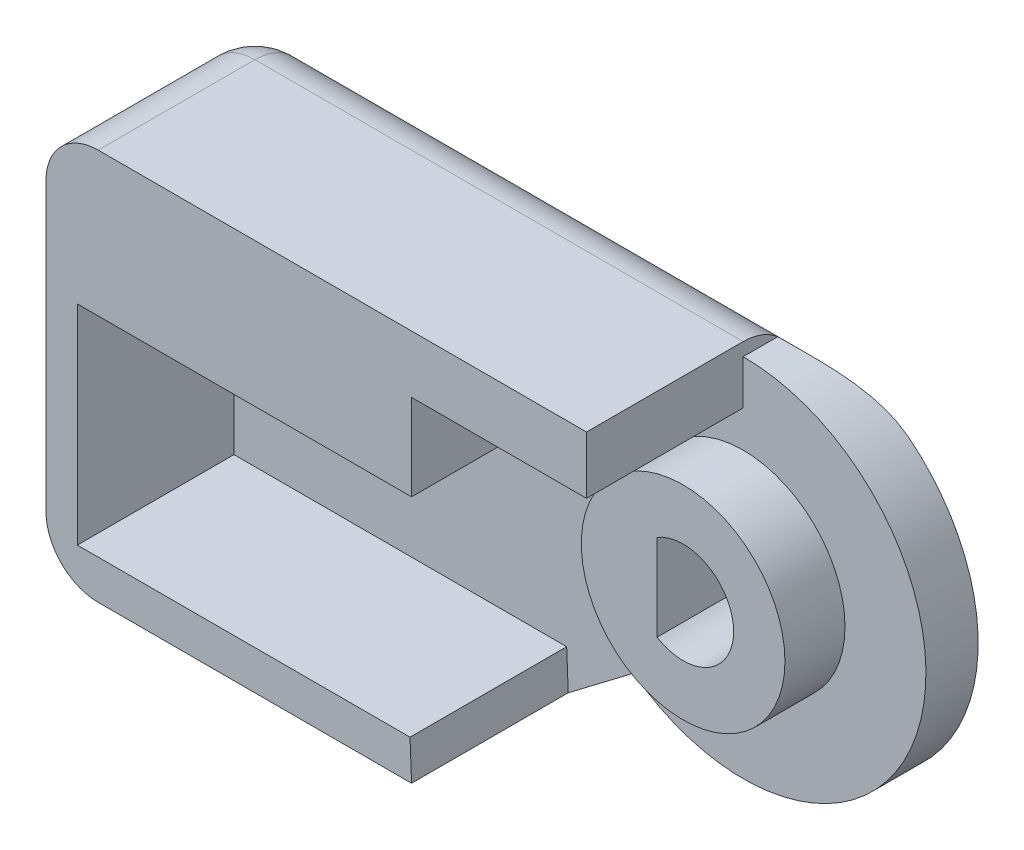
ISO-10303-21;
HEADER;
FILE_DESCRIPTION(('STEP AP214'),'2;1');
FILE_NAME('part.step','',(''),(''),'','','');
FILE_SCHEMA(('AUTOMOTIVE_DESIGN { 1 0 10303 214 1 1 1 1 }'));
ENDSEC;
DATA;
#1=APPLICATION_CONTEXT('core data for automotive mechanical design processes');
#2=APPLICATION_PROTOCOL_DEFINITION('international standard','automotive_design',2000,#1);
#3=PRODUCT_CONTEXT('',#1,'mechanical');
#4=PRODUCT('Part','Part','',(#3));
#5=PRODUCT_RELATED_PRODUCT_CATEGORY('part','',(#4));
#6=PRODUCT_DEFINITION_FORMATION('','',#4);
#7=PRODUCT_DEFINITION_CONTEXT('part definition',#1,'design');
#8=PRODUCT_DEFINITION('design','',#6,#7);
#9=PRODUCT_DEFINITION_SHAPE('','',#8);
#10=(LENGTH_UNIT() NAMED_UNIT(*) SI_UNIT(.MILLI.,.METRE.));
#11=(NAMED_UNIT(*) PLANE_ANGLE_UNIT() SI_UNIT($,.RADIAN.));
#12=(NAMED_UNIT(*) SI_UNIT($,.STERADIAN.) SOLID_ANGLE_UNIT());
#13=UNCERTAINTY_MEASURE_WITH_UNIT(LENGTH_MEASURE(1.E-05),#10,'distance_accuracy_value','');
#14=(GEOMETRIC_REPRESENTATION_CONTEXT(3) GLOBAL_UNCERTAINTY_ASSIGNED_CONTEXT((#13)) GLOBAL_UNIT_ASSIGNED_CONTEXT((#10,
#11,#12)) REPRESENTATION_CONTEXT('',''));
#15=CARTESIAN_POINT('',(0.,0.,0.));
#16=DIRECTION('',(0.,0.,1.));
#17=DIRECTION('',(1.,0.,0.));
#18=AXIS2_PLACEMENT_3D('',#15,#16,#17);
#19=CARTESIAN_POINT('',(-6.69999999999999,-7.5,2.));
#20=DIRECTION('',(-0.605083267533557,0.796162194123103,0.));
#21=DIRECTION('',(-0.796162194123103,-0.605083267533557,0.));
#22=AXIS2_PLACEMENT_3D('',#19,#20,#21);
#23=PLANE('',#22);
#24=DIRECTION('',(0.796162194123103,0.605083267533557,0.));
#25=VECTOR('',#24,1.);
#26=CARTESIAN_POINT('',(-6.69999999999999,-7.5,2.));
#27=LINE('',#26,#25);
#28=CARTESIAN_POINT('',(-6.69999999999999,-7.5,2.));
#29=VERTEX_POINT('',#28);
#30=CARTESIAN_POINT('',(-4.19999999999999,-5.6,2.));
#31=VERTEX_POINT('',#30);
#32=EDGE_CURVE('E356',#29,#31,#27,.T.);
#33=ORIENTED_EDGE('',*,*,#32,.F.);
#34=CARTESIAN_POINT('',(-4.06842105263157,-5.5,2.));
#35=DIRECTION('',(-0.605083267533557,0.796162194123103,0.));
#36=DIRECTION('',(0.796162194123103,0.605083267533557,0.));
#37=AXIS2_PLACEMENT_3D('',#34,#35,#36);
#38=ELLIPSE('',#37,3.30533020381213,2.);
#39=CARTESIAN_POINT('',(-4.19999999999999,-5.6,0.00250156445618212));
#40=VERTEX_POINT('',#39);
#41=EDGE_CURVE('E400',#29,#40,#38,.F.);
#42=ORIENTED_EDGE('',*,*,#41,.T.);
#43=DIRECTION('',(0.,0.,-1.));
#44=VECTOR('',#43,1.);
#45=CARTESIAN_POINT('',(-4.19999999999999,-5.6,2.));
#46=LINE('',#45,#44);
#47=EDGE_CURVE('E374',#31,#40,#46,.T.);
#48=ORIENTED_EDGE('',*,*,#47,.F.);
#49=EDGE_LOOP('',(#33,#42,#48));
#50=FACE_BOUND('',#49,.T.);
#51=ADVANCED_FACE('F41',(#50),#23,.F.);
#52=CARTESIAN_POINT('',(0.,0.,2.));
#53=DIRECTION('',(0.,0.,-1.));
#54=DIRECTION('',(-1.,0.,0.));
#55=AXIS2_PLACEMENT_3D('',#52,#53,#54);
#56=CYLINDRICAL_SURFACE('',#55,7.);
#57=ORIENTED_EDGE('',*,*,#47,.T.);
#58=CARTESIAN_POINT('',(-4.19999999999999,-5.6,0.00250156445618212));
#59=CARTESIAN_POINT('',(-4.14155677091688,-5.64383364656433,0.00469952163115076));
#60=CARTESIAN_POINT('',(-4.08247489335822,-5.68671414896043,0.00828869119228509));
#61=CARTESIAN_POINT('',(-3.96315425682548,-5.77050416877245,0.0179282990885862));
#62=CARTESIAN_POINT('',(-3.90291590041761,-5.81141435525347,0.0239778952453179));
#63=CARTESIAN_POINT('',(-3.72082453154506,-5.9309798197126,0.0453118131867991));
#64=CARTESIAN_POINT('',(-3.59736509532927,-6.00664238183177,0.0637924151711754));
#65=CARTESIAN_POINT('',(-3.34694103931241,-6.14969803370949,0.106993978170742));
#66=CARTESIAN_POINT('',(-3.21997805587572,-6.2170949065567,0.131712068417762));
#67=CARTESIAN_POINT('',(-2.96282067256636,-6.34367735830443,0.18535568403568));
#68=CARTESIAN_POINT('',(-2.83262460876637,-6.4028586012088,0.214283414774047));
#69=CARTESIAN_POINT('',(-2.55606723946253,-6.51852705543578,0.277395553825556));
#70=CARTESIAN_POINT('',(-2.40939692775104,-6.57414491448922,0.311816048074821));
#71=CARTESIAN_POINT('',(-2.11266766002374,-6.67541854490851,0.380697859311953));
#72=CARTESIAN_POINT('',(-1.96260868898433,-6.72107427209771,0.415159176480166));
#73=CARTESIAN_POINT('',(-1.65945968916546,-6.80226188299332,0.481169665050858));
#74=CARTESIAN_POINT('',(-1.50637621880534,-6.83781354685916,0.512724443373316));
#75=CARTESIAN_POINT('',(-1.19706124762865,-6.898686220958,0.569816211850915));
#76=CARTESIAN_POINT('',(-1.04083031774035,-6.92400906939672,0.595354282915791));
#77=CARTESIAN_POINT('',(-0.741807055584375,-6.96204392662197,0.635041896324527));
#78=CARTESIAN_POINT('',(-0.599267353525983,-6.97577794921926,0.650086679191348));
#79=CARTESIAN_POINT('',(-0.312945705052151,-6.99447141663507,0.670805502954452));
#80=CARTESIAN_POINT('',(-0.169164147947374,-6.99943351772978,0.676482380565558));
#81=CARTESIAN_POINT('',(0.118509225457222,-7.00047484194157,0.67766240142979));
#82=CARTESIAN_POINT('',(0.262401059546263,-6.99655201453542,0.673163196178784));
#83=CARTESIAN_POINT('',(0.549064984305977,-6.97991116000069,0.654634160806131));
#84=CARTESIAN_POINT('',(0.691836725118352,-6.96719048748482,0.640601464121234));
#85=CARTESIAN_POINT('',(1.01869387763681,-6.92798825919138,0.599326926659698));
#86=CARTESIAN_POINT('',(1.20206713108597,-6.89848886155583,0.569358504143854));
#87=CARTESIAN_POINT('',(1.56449553853169,-6.82543663573275,0.501438556341681));
#88=CARTESIAN_POINT('',(1.74354792728012,-6.78187505168562,0.463482062398954));
#89=CARTESIAN_POINT('',(2.09743764222899,-6.6809192346073,0.384590854070274));
#90=CARTESIAN_POINT('',(2.27226526394018,-6.62349597142981,0.34365001694542));
#91=CARTESIAN_POINT('',(2.61715107149113,-6.49494935982821,0.263388242099793));
#92=CARTESIAN_POINT('',(2.78721091771817,-6.42383085043541,0.224066738148717));
#93=CARTESIAN_POINT('',(3.07557253038458,-6.28956451681745,0.161400414913937));
#94=CARTESIAN_POINT('',(3.19510577475859,-6.22970775494248,0.136654977700185));
#95=CARTESIAN_POINT('',(3.43116723033019,-6.10287129667491,0.0918422604149061));
#96=CARTESIAN_POINT('',(3.54769715357752,-6.03589577516384,0.0717722601822776));
#97=CARTESIAN_POINT('',(3.77752251184962,-5.89478554704046,0.0380050847969382));
#98=CARTESIAN_POINT('',(3.89081440395201,-5.82064336034643,0.0243146568551023));
#99=CARTESIAN_POINT('',(4.11357352472038,-5.66542534107307,0.00532804373347942));
#100=CARTESIAN_POINT('',(4.22303303287638,-5.5843365324238,4.79456729129283E-05));
#101=CARTESIAN_POINT('',(4.33012701892219,-5.5,0.));
#102=B_SPLINE_CURVE_WITH_KNOTS('',3,(#58,#59,#60,#61,#62,#63,#64,#65,#66,#67,#68,#69,#70,#71,
#72,#73,#74,#75,#76,#77,#78,#79,#80,#81,#82,#83,#84,#85,#86,#87,#88,#89,#90,#91,#92,#93,#94,#95,
#96,#97,#98,#99,#100,#101),.UNSPECIFIED.,.F.,.F.,(4,2,2,2,2,2,2,2,2,2,2,2,2,2,2,2,2,2,2,2,2,4),
(0.,0.219209885988927,0.438344801777697,0.87575445923389,1.31296316741287,1.75040175279814,
2.23182859789322,2.71325757781189,3.19373749518885,3.67413102775403,4.10557814433781,
4.53689458953522,4.96831058696951,5.39985636150716,5.96331979179677,6.52713474308106,
7.09214088050539,7.65694774569477,8.06454899182243,8.47191250067759,8.87970587595175,
9.28827833796954),.UNSPECIFIED.);
#103=CARTESIAN_POINT('',(4.33012701892219,-5.5,0.));
#104=VERTEX_POINT('',#103);
#105=EDGE_CURVE('E411',#40,#104,#102,.T.);
#106=ORIENTED_EDGE('',*,*,#105,.T.);
#107=CARTESIAN_POINT('',(0.,0.,0.));
#108=DIRECTION('',(0.,0.,1.));
#109=DIRECTION('',(1.,0.,0.));
#110=AXIS2_PLACEMENT_3D('',#107,#108,#109);
#111=CIRCLE('',#110,7.);
#112=CARTESIAN_POINT('',(4.33012701892219,5.5,0.));
#113=VERTEX_POINT('',#112);
#114=EDGE_CURVE('E355',#104,#113,#111,.T.);
#115=ORIENTED_EDGE('',*,*,#114,.T.);
#116=CARTESIAN_POINT('',(4.33012701892219,5.5,0.));
#117=CARTESIAN_POINT('',(4.27565134419388,5.54288992095722,3.16448744951972E-06));
#118=CARTESIAN_POINT('',(4.22055118908445,5.58495739955612,0.00137920884955097));
#119=CARTESIAN_POINT('',(4.10921982008807,5.66737191207902,0.00658748503671268));
#120=CARTESIAN_POINT('',(4.05298900283181,5.70771953434261,0.0104188696136269));
#121=CARTESIAN_POINT('',(3.88295201251372,5.82595174356898,0.0251434771142648));
#122=CARTESIAN_POINT('',(3.76757811117118,5.90120123642492,0.0392695438128536));
#123=CARTESIAN_POINT('',(3.53316867796608,6.04447147088369,0.0741248490571788));
#124=CARTESIAN_POINT('',(3.41412708120154,6.1124793078429,0.094865620778447));
#125=CARTESIAN_POINT('',(3.17294121303797,6.24108419799872,0.141111818725817));
#126=CARTESIAN_POINT('',(3.05079519338518,6.30167695848424,0.166619983484103));
#127=CARTESIAN_POINT('',(2.74812720661775,6.44101724938366,0.232849874085873));
#128=CARTESIAN_POINT('',(2.56607670619923,6.51566010661691,0.27525138661051));
#129=CARTESIAN_POINT('',(2.19652066267236,6.64935665492527,0.361312510867563));
#130=CARTESIAN_POINT('',(2.00901163571028,6.70840013643442,0.404972925905956));
#131=CARTESIAN_POINT('',(1.62962349203863,6.81048795248792,0.487744833269802));
#132=CARTESIAN_POINT('',(1.43776817655619,6.85360395089615,0.526876143503462));
#133=CARTESIAN_POINT('',(1.04942307798488,6.9236918644417,0.594473504953196));
#134=CARTESIAN_POINT('',(0.852940942642479,6.95068870969871,0.622956000141599));
#135=CARTESIAN_POINT('',(0.546501946559715,6.97948287023724,0.654132927098202));
#136=CARTESIAN_POINT('',(0.437672325863815,6.98715560354278,0.662664486590381));
#137=CARTESIAN_POINT('',(0.219244394723554,6.99742378237191,0.674200947052606));
#138=CARTESIAN_POINT('',(0.109644915216933,7.00000793768722,0.677193557679663));
#139=CARTESIAN_POINT('',(0.,7.,0.677124344467703));
#140=B_SPLINE_CURVE_WITH_KNOTS('',3,(#116,#117,#118,#119,#120,#121,#122,#123,#124,#125,#126,
#127,#128,#129,#130,#131,#132,#133,#134,#135,#136,#137,#138,#139),.UNSPECIFIED.,.F.,.F.,(4,2,2,
2,2,2,2,2,2,2,2,4),(0.,0.207949790420002,0.415827863578031,0.830735142610161,1.24636983164467,
1.66224401152001,2.26531055542352,2.868770825355,3.46948183474742,4.06926135273695,
4.39731920210125,4.72610410855595),.UNSPECIFIED.);
#141=CARTESIAN_POINT('',(0.,7.,0.677124344467706));
#142=VERTEX_POINT('',#141);
#143=EDGE_CURVE('E403',#113,#142,#140,.T.);
#144=ORIENTED_EDGE('',*,*,#143,.T.);
#145=DIRECTION('',(0.,0.,-1.));
#146=VECTOR('',#145,1.);
#147=CARTESIAN_POINT('',(0.,7.,2.));
#148=LINE('',#147,#146);
#149=CARTESIAN_POINT('',(0.,7.,2.));
#150=VERTEX_POINT('',#149);
#151=EDGE_CURVE('E370',#150,#142,#148,.T.);
#152=ORIENTED_EDGE('',*,*,#151,.F.);
#153=CARTESIAN_POINT('',(0.,0.,2.));
#154=DIRECTION('',(0.,0.,1.));
#155=DIRECTION('',(1.,0.,0.));
#156=AXIS2_PLACEMENT_3D('',#153,#154,#155);
#157=CIRCLE('',#156,7.);
#158=EDGE_CURVE('E360',#31,#150,#157,.T.);
#159=ORIENTED_EDGE('',*,*,#158,.F.);
#160=EDGE_LOOP('',(#57,#106,#115,#144,#152,#159));
#161=FACE_BOUND('',#160,.T.);
#162=ADVANCED_FACE('F418',(#161),#56,.T.);
#163=CARTESIAN_POINT('',(0.,7.,2.));
#164=DIRECTION('',(-1.,0.,0.));
#165=DIRECTION('',(0.,0.,1.));
#166=AXIS2_PLACEMENT_3D('',#163,#164,#165);
#167=PLANE('',#166);
#168=ORIENTED_EDGE('',*,*,#151,.T.);
#169=CARTESIAN_POINT('',(0.,5.5,2.));
#170=DIRECTION('',(-1.,0.,0.));
#171=DIRECTION('',(0.,0.,1.));
#172=AXIS2_PLACEMENT_3D('',#169,#170,#171);
#173=CIRCLE('',#172,2.);
#174=CARTESIAN_POINT('',(0.,7.5,2.));
#175=VERTEX_POINT('',#174);
#176=EDGE_CURVE('E11',#142,#175,#173,.F.);
#177=ORIENTED_EDGE('',*,*,#176,.T.);
#178=DIRECTION('',(0.,0.,-1.));
#179=VECTOR('',#178,1.);
#180=CARTESIAN_POINT('',(0.,7.5,2.));
#181=LINE('',#180,#179);
#182=CARTESIAN_POINT('',(0.,7.5,8.));
#183=VERTEX_POINT('',#182);
#184=EDGE_CURVE('E363',#183,#175,#181,.T.);
#185=ORIENTED_EDGE('',*,*,#184,.F.);
#186=DIRECTION('',(0.,1.,0.));
#187=VECTOR('',#186,1.);
#188=CARTESIAN_POINT('',(0.,5.3,8.));
#189=LINE('',#188,#187);
#190=CARTESIAN_POINT('',(0.,5.3,8.));
#191=VERTEX_POINT('',#190);
#192=EDGE_CURVE('E288',#191,#183,#189,.T.);
#193=ORIENTED_EDGE('',*,*,#192,.F.);
#194=DIRECTION('',(0.,0.,-1.));
#195=VECTOR('',#194,1.);
#196=CARTESIAN_POINT('',(0.,5.3,8.));
#197=LINE('',#196,#195);
#198=CARTESIAN_POINT('',(0.,5.3,2.));
#199=VERTEX_POINT('',#198);
#200=EDGE_CURVE('E300',#191,#199,#197,.T.);
#201=ORIENTED_EDGE('',*,*,#200,.T.);
#202=DIRECTION('',(0.,1.,0.));
#203=VECTOR('',#202,1.);
#204=CARTESIAN_POINT('',(0.,5.3,2.));
#205=LINE('',#204,#203);
#206=EDGE_CURVE('E270',#199,#150,#205,.T.);
#207=ORIENTED_EDGE('',*,*,#206,.T.);
#208=EDGE_LOOP('',(#168,#177,#185,#193,#201,#207));
#209=FACE_BOUND('',#208,.T.);
#210=ADVANCED_FACE('F423',(#209),#167,.F.);
#211=CARTESIAN_POINT('',(-2.5,7.5,2.));
#212=DIRECTION('',(0.,-1.,0.));
#213=DIRECTION('',(1.,0.,0.));
#214=AXIS2_PLACEMENT_3D('',#211,#212,#213);
#215=PLANE('',#214);
#216=ORIENTED_EDGE('',*,*,#184,.T.);
#217=DIRECTION('',(-1.,0.,0.));
#218=VECTOR('',#217,1.);
#219=CARTESIAN_POINT('',(-2.5,7.5,2.));
#220=LINE('',#219,#218);
#221=CARTESIAN_POINT('',(-18.7,7.5,2.));
#222=VERTEX_POINT('',#221);
#223=EDGE_CURVE('E52',#175,#222,#220,.T.);
#224=ORIENTED_EDGE('',*,*,#223,.T.);
#225=DIRECTION('',(0.,0.,-1.));
#226=VECTOR('',#225,1.);
#227=CARTESIAN_POINT('',(-18.7,7.5,2.));
#228=LINE('',#227,#226);
#229=CARTESIAN_POINT('',(-18.7,7.5,8.));
#230=VERTEX_POINT('',#229);
#231=EDGE_CURVE('E461',#222,#230,#228,.F.);
#232=ORIENTED_EDGE('',*,*,#231,.T.);
#233=DIRECTION('',(-1.,0.,0.));
#234=VECTOR('',#233,1.);
#235=CARTESIAN_POINT('',(-0.699999999999992,7.5,8.));
#236=LINE('',#235,#234);
#237=EDGE_CURVE('E292',#183,#230,#236,.T.);
#238=ORIENTED_EDGE('',*,*,#237,.F.);
#239=EDGE_LOOP('',(#216,#224,#232,#238));
#240=FACE_BOUND('',#239,.T.);
#241=ADVANCED_FACE('F543',(#240),#215,.F.);
#242=CARTESIAN_POINT('',(-20.7,7.5,2.));
#243=DIRECTION('',(1.,0.,0.));
#244=DIRECTION('',(0.,1.,0.));
#245=AXIS2_PLACEMENT_3D('',#242,#243,#244);
#246=PLANE('',#245);
#247=DIRECTION('',(0.,-1.,0.));
#248=VECTOR('',#247,1.);
#249=CARTESIAN_POINT('',(-20.7,7.5,2.));
#250=LINE('',#249,#248);
#251=CARTESIAN_POINT('',(-20.7,5.5,2.));
#252=VERTEX_POINT('',#251);
#253=CARTESIAN_POINT('',(-20.7,-5.5,2.));
#254=VERTEX_POINT('',#253);
#255=EDGE_CURVE('E388',#252,#254,#250,.T.);
#256=ORIENTED_EDGE('',*,*,#255,.T.);
#257=DIRECTION('',(0.,0.,-1.));
#258=VECTOR('',#257,1.);
#259=CARTESIAN_POINT('',(-20.7,-5.50000000000001,2.));
#260=LINE('',#259,#258);
#261=CARTESIAN_POINT('',(-20.7,-5.5,8.));
#262=VERTEX_POINT('',#261);
#263=EDGE_CURVE('E391',#254,#262,#260,.F.);
#264=ORIENTED_EDGE('',*,*,#263,.T.);
#265=DIRECTION('',(0.,-1.,0.));
#266=VECTOR('',#265,1.);
#267=CARTESIAN_POINT('',(-20.7,-7.5,8.));
#268=LINE('',#267,#266);
#269=CARTESIAN_POINT('',(-20.7,5.49999999999999,8.));
#270=VERTEX_POINT('',#269);
#271=EDGE_CURVE('E296',#270,#262,#268,.T.);
#272=ORIENTED_EDGE('',*,*,#271,.F.);
#273=DIRECTION('',(0.,0.,-1.));
#274=VECTOR('',#273,1.);
#275=CARTESIAN_POINT('',(-20.7,5.5,2.));
#276=LINE('',#275,#274);
#277=EDGE_CURVE('E385',#270,#252,#276,.T.);
#278=ORIENTED_EDGE('',*,*,#277,.T.);
#279=EDGE_LOOP('',(#256,#264,#272,#278));
#280=FACE_BOUND('',#279,.T.);
#281=ADVANCED_FACE('F469',(#280),#246,.F.);
#282=CARTESIAN_POINT('',(-20.7,-7.5,2.));
#283=DIRECTION('',(0.,1.,0.));
#284=DIRECTION('',(-1.,0.,0.));
#285=AXIS2_PLACEMENT_3D('',#282,#283,#284);
#286=PLANE('',#285);
#287=DIRECTION('',(1.,0.,0.));
#288=VECTOR('',#287,1.);
#289=CARTESIAN_POINT('',(-19.2926245405216,-7.5,8.));
#290=LINE('',#289,#288);
#291=CARTESIAN_POINT('',(-18.7,-7.5,8.));
#292=VERTEX_POINT('',#291);
#293=CARTESIAN_POINT('',(-6.69999999999999,-7.5,8.));
#294=VERTEX_POINT('',#293);
#295=EDGE_CURVE('E266',#292,#294,#290,.T.);
#296=ORIENTED_EDGE('',*,*,#295,.F.);
#297=DIRECTION('',(0.,0.,-1.));
#298=VECTOR('',#297,1.);
#299=CARTESIAN_POINT('',(-18.7,-7.5,2.));
#300=LINE('',#299,#298);
#301=CARTESIAN_POINT('',(-18.7,-7.5,2.));
#302=VERTEX_POINT('',#301);
#303=EDGE_CURVE('E381',#292,#302,#300,.T.);
#304=ORIENTED_EDGE('',*,*,#303,.T.);
#305=DIRECTION('',(1.,0.,0.));
#306=VECTOR('',#305,1.);
#307=CARTESIAN_POINT('',(-20.7,-7.5,2.));
#308=LINE('',#307,#306);
#309=EDGE_CURVE('E378',#302,#29,#308,.T.);
#310=ORIENTED_EDGE('',*,*,#309,.T.);
#311=DIRECTION('',(0.,0.,-1.));
#312=VECTOR('',#311,1.);
#313=CARTESIAN_POINT('',(-6.69999999999999,-7.5,8.));
#314=LINE('',#313,#312);
#315=EDGE_CURVE('E351',#294,#29,#314,.T.);
#316=ORIENTED_EDGE('',*,*,#315,.F.);
#317=EDGE_LOOP('',(#296,#304,#310,#316));
#318=FACE_BOUND('',#317,.T.);
#319=ADVANCED_FACE('F513',(#318),#286,.F.);
#320=CARTESIAN_POINT('',(0.,0.,2.));
#321=DIRECTION('',(0.,0.,1.));
#322=DIRECTION('',(1.,0.,0.));
#323=AXIS2_PLACEMENT_3D('',#320,#321,#322);
#324=PLANE('',#323);
#325=CARTESIAN_POINT('',(0.,0.,2.));
#326=DIRECTION('',(0.,0.,1.));
#327=DIRECTION('',(1.,0.,0.));
#328=AXIS2_PLACEMENT_3D('',#325,#326,#327);
#329=CIRCLE('',#328,3.9);
#330=CARTESIAN_POINT('',(3.9,0.,2.));
#331=VERTEX_POINT('',#330);
#332=EDGE_CURVE('E248',#331,#331,#329,.T.);
#333=ORIENTED_EDGE('',*,*,#332,.F.);
#334=EDGE_LOOP('',(#333));
#335=FACE_BOUND('',#334,.T.);
#336=ORIENTED_EDGE('',*,*,#206,.F.);
#337=DIRECTION('',(1.,0.,0.));
#338=VECTOR('',#337,1.);
#339=CARTESIAN_POINT('',(-0.699999999999992,5.3,2.));
#340=LINE('',#339,#338);
#341=CARTESIAN_POINT('',(-6.69999999999999,5.3,2.));
#342=VERTEX_POINT('',#341);
#343=EDGE_CURVE('E320',#342,#199,#340,.T.);
#344=ORIENTED_EDGE('',*,*,#343,.F.);
#345=DIRECTION('',(0.,1.,0.));
#346=VECTOR('',#345,1.);
#347=CARTESIAN_POINT('',(-6.69999999999999,2.,2.));
#348=LINE('',#347,#346);
#349=CARTESIAN_POINT('',(-6.69999999999999,2.,2.));
#350=VERTEX_POINT('',#349);
#351=EDGE_CURVE('E316',#350,#342,#348,.T.);
#352=ORIENTED_EDGE('',*,*,#351,.F.);
#353=DIRECTION('',(1.,0.,0.));
#354=VECTOR('',#353,1.);
#355=CARTESIAN_POINT('',(-6.69999999999999,2.,2.));
#356=LINE('',#355,#354);
#357=CARTESIAN_POINT('',(-19.5,2.,2.));
#358=VERTEX_POINT('',#357);
#359=EDGE_CURVE('E312',#358,#350,#356,.T.);
#360=ORIENTED_EDGE('',*,*,#359,.F.);
#361=DIRECTION('',(0.,1.,0.));
#362=VECTOR('',#361,1.);
#363=CARTESIAN_POINT('',(-19.5,2.,2.));
#364=LINE('',#363,#362);
#365=CARTESIAN_POINT('',(-19.5,-6.00000000000001,2.));
#366=VERTEX_POINT('',#365);
#367=EDGE_CURVE('E308',#366,#358,#364,.T.);
#368=ORIENTED_EDGE('',*,*,#367,.F.);
#369=DIRECTION('',(-1.,0.,0.));
#370=VECTOR('',#369,1.);
#371=CARTESIAN_POINT('',(-6.75907917408683,-6.,2.));
#372=LINE('',#371,#370);
#373=CARTESIAN_POINT('',(-6.75907917408683,-6.,2.));
#374=VERTEX_POINT('',#373);
#375=EDGE_CURVE('E304',#374,#366,#372,.T.);
#376=ORIENTED_EDGE('',*,*,#375,.F.);
#377=DIRECTION('',(-0.0393556023803529,0.99922526817594,0.));
#378=VECTOR('',#377,1.);
#379=CARTESIAN_POINT('',(-6.69999999999999,-7.5,2.));
#380=LINE('',#379,#378);
#381=EDGE_CURVE('E262',#29,#374,#380,.T.);
#382=ORIENTED_EDGE('',*,*,#381,.F.);
#383=ORIENTED_EDGE('',*,*,#32,.T.);
#384=ORIENTED_EDGE('',*,*,#158,.T.);
#385=EDGE_LOOP('',(#336,#344,#352,#360,#368,#376,#382,#383,#384));
#386=FACE_BOUND('',#385,.T.);
#387=ADVANCED_FACE('F559',(#335,#386),#324,.T.);
#388=CARTESIAN_POINT('',(0.,0.,0.));
#389=DIRECTION('',(0.,0.,1.));
#390=DIRECTION('',(1.,0.,0.));
#391=AXIS2_PLACEMENT_3D('',#388,#389,#390);
#392=PLANE('',#391);
#393=DIRECTION('',(0.,-1.,0.));
#394=VECTOR('',#393,1.);
#395=CARTESIAN_POINT('',(-1.,0.,0.));
#396=LINE('',#395,#394);
#397=CARTESIAN_POINT('',(-1.,1.65627814756084,0.));
#398=VERTEX_POINT('',#397);
#399=CARTESIAN_POINT('',(-1.,-1.65627814756084,0.));
#400=VERTEX_POINT('',#399);
#401=EDGE_CURVE('E196',#398,#400,#396,.T.);
#402=ORIENTED_EDGE('',*,*,#401,.T.);
#403=CARTESIAN_POINT('',(0.,0.,0.));
#404=DIRECTION('',(0.,0.,1.));
#405=DIRECTION('',(1.,0.,0.));
#406=AXIS2_PLACEMENT_3D('',#403,#404,#405);
#407=CIRCLE('',#406,1.93474993270127);
#408=EDGE_CURVE('E193',#400,#398,#407,.T.);
#409=ORIENTED_EDGE('',*,*,#408,.T.);
#410=EDGE_LOOP('',(#402,#409));
#411=FACE_BOUND('',#410,.T.);
#412=ORIENTED_EDGE('',*,*,#114,.F.);
#413=DIRECTION('',(1.,0.,0.));
#414=VECTOR('',#413,1.);
#415=CARTESIAN_POINT('',(0.,-5.5,0.));
#416=LINE('',#415,#414);
#417=CARTESIAN_POINT('',(-18.7,-5.5,0.));
#418=VERTEX_POINT('',#417);
#419=EDGE_CURVE('E508',#104,#418,#416,.F.);
#420=ORIENTED_EDGE('',*,*,#419,.T.);
#421=DIRECTION('',(0.,-1.,0.));
#422=VECTOR('',#421,1.);
#423=CARTESIAN_POINT('',(-18.7,0.,0.));
#424=LINE('',#423,#422);
#425=CARTESIAN_POINT('',(-18.7,5.5,0.));
#426=VERTEX_POINT('',#425);
#427=EDGE_CURVE('E501',#418,#426,#424,.F.);
#428=ORIENTED_EDGE('',*,*,#427,.T.);
#429=DIRECTION('',(-1.,0.,0.));
#430=VECTOR('',#429,1.);
#431=CARTESIAN_POINT('',(0.,5.5,0.));
#432=LINE('',#431,#430);
#433=EDGE_CURVE('E504',#426,#113,#432,.F.);
#434=ORIENTED_EDGE('',*,*,#433,.T.);
#435=EDGE_LOOP('',(#412,#420,#428,#434));
#436=FACE_BOUND('',#435,.T.);
#437=ADVANCED_FACE('F552',(#411,#436),#392,.F.);
#438=CARTESIAN_POINT('',(-6.69999999999999,-7.5,8.));
#439=DIRECTION('',(-0.99922526817594,-0.0393556023803529,0.));
#440=DIRECTION('',(0.0393556023803529,-0.99922526817594,0.));
#441=AXIS2_PLACEMENT_3D('',#438,#439,#440);
#442=PLANE('',#441);
#443=ORIENTED_EDGE('',*,*,#381,.T.);
#444=DIRECTION('',(0.,0.,-1.));
#445=VECTOR('',#444,1.);
#446=CARTESIAN_POINT('',(-6.75907917408683,-6.,8.));
#447=LINE('',#446,#445);
#448=CARTESIAN_POINT('',(-6.75907917408683,-6.,8.));
#449=VERTEX_POINT('',#448);
#450=EDGE_CURVE('E347',#449,#374,#447,.T.);
#451=ORIENTED_EDGE('',*,*,#450,.F.);
#452=DIRECTION('',(-0.0393556023803529,0.99922526817594,0.));
#453=VECTOR('',#452,1.);
#454=CARTESIAN_POINT('',(-6.69999999999999,-7.5,8.));
#455=LINE('',#454,#453);
#456=EDGE_CURVE('E269',#294,#449,#455,.T.);
#457=ORIENTED_EDGE('',*,*,#456,.F.);
#458=ORIENTED_EDGE('',*,*,#315,.T.);
#459=EDGE_LOOP('',(#443,#451,#457,#458));
#460=FACE_BOUND('',#459,.T.);
#461=ADVANCED_FACE('F519',(#460),#442,.F.);
#462=CARTESIAN_POINT('',(-6.75907917408683,-6.,8.));
#463=DIRECTION('',(0.,-1.,0.));
#464=DIRECTION('',(1.,0.,0.));
#465=AXIS2_PLACEMENT_3D('',#462,#463,#464);
#466=PLANE('',#465);
#467=ORIENTED_EDGE('',*,*,#375,.T.);
#468=DIRECTION('',(0.,0.,-1.));
#469=VECTOR('',#468,1.);
#470=CARTESIAN_POINT('',(-19.5,-6.00000000000001,8.));
#471=LINE('',#470,#469);
#472=CARTESIAN_POINT('',(-19.5,-6.00000000000001,8.));
#473=VERTEX_POINT('',#472);
#474=EDGE_CURVE('E343',#473,#366,#471,.T.);
#475=ORIENTED_EDGE('',*,*,#474,.F.);
#476=DIRECTION('',(-1.,0.,0.));
#477=VECTOR('',#476,1.);
#478=CARTESIAN_POINT('',(-6.75907917408683,-6.,8.));
#479=LINE('',#478,#477);
#480=EDGE_CURVE('E273',#449,#473,#479,.T.);
#481=ORIENTED_EDGE('',*,*,#480,.F.);
#482=ORIENTED_EDGE('',*,*,#450,.T.);
#483=EDGE_LOOP('',(#467,#475,#481,#482));
#484=FACE_BOUND('',#483,.T.);
#485=ADVANCED_FACE('F521',(#484),#466,.F.);
#486=CARTESIAN_POINT('',(-19.5,2.,8.));
#487=DIRECTION('',(-1.,0.,0.));
#488=DIRECTION('',(0.,0.,1.));
#489=AXIS2_PLACEMENT_3D('',#486,#487,#488);
#490=PLANE('',#489);
#491=ORIENTED_EDGE('',*,*,#367,.T.);
#492=DIRECTION('',(0.,0.,-1.));
#493=VECTOR('',#492,1.);
#494=CARTESIAN_POINT('',(-19.5,2.,8.));
#495=LINE('',#494,#493);
#496=CARTESIAN_POINT('',(-19.5,2.,8.));
#497=VERTEX_POINT('',#496);
#498=EDGE_CURVE('E339',#497,#358,#495,.T.);
#499=ORIENTED_EDGE('',*,*,#498,.F.);
#500=DIRECTION('',(0.,1.,0.));
#501=VECTOR('',#500,1.);
#502=CARTESIAN_POINT('',(-19.5,2.,8.));
#503=LINE('',#502,#501);
#504=EDGE_CURVE('E276',#473,#497,#503,.T.);
#505=ORIENTED_EDGE('',*,*,#504,.F.);
#506=ORIENTED_EDGE('',*,*,#474,.T.);
#507=EDGE_LOOP('',(#491,#499,#505,#506));
#508=FACE_BOUND('',#507,.T.);
#509=ADVANCED_FACE('F525',(#508),#490,.F.);
#510=CARTESIAN_POINT('',(-6.69999999999999,2.,8.));
#511=DIRECTION('',(0.,1.,0.));
#512=DIRECTION('',(-1.,0.,0.));
#513=AXIS2_PLACEMENT_3D('',#510,#511,#512);
#514=PLANE('',#513);
#515=ORIENTED_EDGE('',*,*,#359,.T.);
#516=DIRECTION('',(0.,0.,-1.));
#517=VECTOR('',#516,1.);
#518=CARTESIAN_POINT('',(-6.69999999999999,2.,8.));
#519=LINE('',#518,#517);
#520=CARTESIAN_POINT('',(-6.69999999999999,2.,8.));
#521=VERTEX_POINT('',#520);
#522=EDGE_CURVE('E335',#521,#350,#519,.T.);
#523=ORIENTED_EDGE('',*,*,#522,.F.);
#524=DIRECTION('',(1.,0.,0.));
#525=VECTOR('',#524,1.);
#526=CARTESIAN_POINT('',(-6.69999999999999,2.,8.));
#527=LINE('',#526,#525);
#528=EDGE_CURVE('E279',#497,#521,#527,.T.);
#529=ORIENTED_EDGE('',*,*,#528,.F.);
#530=ORIENTED_EDGE('',*,*,#498,.T.);
#531=EDGE_LOOP('',(#515,#523,#529,#530));
#532=FACE_BOUND('',#531,.T.);
#533=ADVANCED_FACE('F531',(#532),#514,.F.);
#534=CARTESIAN_POINT('',(-6.69999999999999,2.,8.));
#535=DIRECTION('',(-1.,0.,0.));
#536=DIRECTION('',(0.,0.,1.));
#537=AXIS2_PLACEMENT_3D('',#534,#535,#536);
#538=PLANE('',#537);
#539=DIRECTION('',(0.,0.,-1.));
#540=VECTOR('',#539,1.);
#541=CARTESIAN_POINT('',(-6.69999999999999,3.97582151925491,4.46589940564022));
#542=LINE('',#541,#540);
#543=CARTESIAN_POINT('',(-6.69999999999999,3.97582151925491,4.46589940564022));
#544=VERTEX_POINT('',#543);
#545=CARTESIAN_POINT('',(-6.69999999999999,3.97582151925491,2.05728738402851));
#546=VERTEX_POINT('',#545);
#547=EDGE_CURVE('E235',#544,#546,#542,.T.);
#548=ORIENTED_EDGE('',*,*,#547,.F.);
#549=DIRECTION('',(0.,-1.,0.));
#550=VECTOR('',#549,1.);
#551=CARTESIAN_POINT('',(-6.69999999999999,3.97582151925491,4.46589940564022));
#552=LINE('',#551,#550);
#553=CARTESIAN_POINT('',(-6.69999999999999,5.3,4.46589940564022));
#554=VERTEX_POINT('',#553);
#555=EDGE_CURVE('E222',#554,#544,#552,.T.);
#556=ORIENTED_EDGE('',*,*,#555,.F.);
#557=DIRECTION('',(0.,0.,-1.));
#558=VECTOR('',#557,1.);
#559=CARTESIAN_POINT('',(-6.69999999999999,5.3,8.));
#560=LINE('',#559,#558);
#561=CARTESIAN_POINT('',(-6.69999999999999,5.3,8.));
#562=VERTEX_POINT('',#561);
#563=EDGE_CURVE('E331',#562,#554,#560,.T.);
#564=ORIENTED_EDGE('',*,*,#563,.F.);
#565=DIRECTION('',(0.,1.,0.));
#566=VECTOR('',#565,1.);
#567=CARTESIAN_POINT('',(-6.69999999999999,2.,8.));
#568=LINE('',#567,#566);
#569=EDGE_CURVE('E282',#521,#562,#568,.T.);
#570=ORIENTED_EDGE('',*,*,#569,.F.);
#571=ORIENTED_EDGE('',*,*,#522,.T.);
#572=ORIENTED_EDGE('',*,*,#351,.T.);
#573=CARTESIAN_POINT('',(-6.69999999999999,5.3,2.0572873840285));
#574=VERTEX_POINT('',#573);
#575=EDGE_CURVE('E330',#574,#342,#560,.T.);
#576=ORIENTED_EDGE('',*,*,#575,.F.);
#577=DIRECTION('',(0.,1.,0.));
#578=VECTOR('',#577,1.);
#579=CARTESIAN_POINT('',(-6.69999999999999,3.97582151925491,2.05728738402851));
#580=LINE('',#579,#578);
#581=EDGE_CURVE('E239',#546,#574,#580,.T.);
#582=ORIENTED_EDGE('',*,*,#581,.F.);
#583=EDGE_LOOP('',(#548,#556,#564,#570,#571,#572,#576,#582));
#584=FACE_BOUND('',#583,.T.);
#585=ADVANCED_FACE('F534',(#584),#538,.F.);
#586=CARTESIAN_POINT('',(-0.699999999999992,5.3,8.));
#587=DIRECTION('',(0.,1.,0.));
#588=DIRECTION('',(0.,0.,1.));
#589=AXIS2_PLACEMENT_3D('',#586,#587,#588);
#590=PLANE('',#589);
#591=ORIENTED_EDGE('',*,*,#343,.T.);
#592=ORIENTED_EDGE('',*,*,#200,.F.);
#593=DIRECTION('',(1.,0.,0.));
#594=VECTOR('',#593,1.);
#595=CARTESIAN_POINT('',(-6.69999999999999,5.3,8.));
#596=LINE('',#595,#594);
#597=EDGE_CURVE('E285',#562,#191,#596,.T.);
#598=ORIENTED_EDGE('',*,*,#597,.F.);
#599=ORIENTED_EDGE('',*,*,#563,.T.);
#600=DIRECTION('',(1.,0.,0.));
#601=VECTOR('',#600,1.);
#602=CARTESIAN_POINT('',(-14.7,5.3,4.46589940564022));
#603=LINE('',#602,#601);
#604=CARTESIAN_POINT('',(-14.7,5.3,4.46589940564022));
#605=VERTEX_POINT('',#604);
#606=EDGE_CURVE('E249',#605,#554,#603,.T.);
#607=ORIENTED_EDGE('',*,*,#606,.F.);
#608=DIRECTION('',(0.,0.,1.));
#609=VECTOR('',#608,1.);
#610=CARTESIAN_POINT('',(-14.7,5.3,4.46589940564022));
#611=LINE('',#610,#609);
#612=CARTESIAN_POINT('',(-14.7,5.3,2.05728738402851));
#613=VERTEX_POINT('',#612);
#614=EDGE_CURVE('E226',#613,#605,#611,.T.);
#615=ORIENTED_EDGE('',*,*,#614,.F.);
#616=DIRECTION('',(1.,0.,0.));
#617=VECTOR('',#616,1.);
#618=CARTESIAN_POINT('',(-14.7,5.3,2.05728738402851));
#619=LINE('',#618,#617);
#620=EDGE_CURVE('E252',#613,#574,#619,.T.);
#621=ORIENTED_EDGE('',*,*,#620,.T.);
#622=ORIENTED_EDGE('',*,*,#575,.T.);
#623=EDGE_LOOP('',(#591,#592,#598,#599,#607,#615,#621,#622));
#624=FACE_BOUND('',#623,.T.);
#625=ADVANCED_FACE('F539',(#624),#590,.F.);
#626=CARTESIAN_POINT('',(0.,0.,8.));
#627=DIRECTION('',(0.,0.,-1.));
#628=DIRECTION('',(-1.,0.,0.));
#629=AXIS2_PLACEMENT_3D('',#626,#627,#628);
#630=PLANE('',#629);
#631=ORIENTED_EDGE('',*,*,#271,.T.);
#632=CARTESIAN_POINT('',(-18.7,-5.5,8.));
#633=DIRECTION('',(0.,0.,-1.));
#634=DIRECTION('',(-1.,0.,0.));
#635=AXIS2_PLACEMENT_3D('',#632,#633,#634);
#636=CIRCLE('',#635,2.);
#637=EDGE_CURVE('E397',#262,#292,#636,.F.);
#638=ORIENTED_EDGE('',*,*,#637,.T.);
#639=ORIENTED_EDGE('',*,*,#295,.T.);
#640=ORIENTED_EDGE('',*,*,#456,.T.);
#641=ORIENTED_EDGE('',*,*,#480,.T.);
#642=ORIENTED_EDGE('',*,*,#504,.T.);
#643=ORIENTED_EDGE('',*,*,#528,.T.);
#644=ORIENTED_EDGE('',*,*,#569,.T.);
#645=ORIENTED_EDGE('',*,*,#597,.T.);
#646=ORIENTED_EDGE('',*,*,#192,.T.);
#647=ORIENTED_EDGE('',*,*,#237,.T.);
#648=CARTESIAN_POINT('',(-18.7,5.5,8.));
#649=DIRECTION('',(0.,0.,-1.));
#650=DIRECTION('',(-1.,0.,0.));
#651=AXIS2_PLACEMENT_3D('',#648,#649,#650);
#652=CIRCLE('',#651,2.);
#653=EDGE_CURVE('E394',#230,#270,#652,.F.);
#654=ORIENTED_EDGE('',*,*,#653,.T.);
#655=EDGE_LOOP('',(#631,#638,#639,#640,#641,#642,#643,#644,#645,#646,#647,#654));
#656=FACE_BOUND('',#655,.T.);
#657=ADVANCED_FACE('F465',(#656),#630,.F.);
#658=CARTESIAN_POINT('',(0.,0.,4.3));
#659=DIRECTION('',(0.,0.,-1.));
#660=DIRECTION('',(-1.,0.,0.));
#661=AXIS2_PLACEMENT_3D('',#658,#659,#660);
#662=CYLINDRICAL_SURFACE('',#661,3.9);
#663=CARTESIAN_POINT('',(0.,0.,4.3));
#664=DIRECTION('',(0.,0.,1.));
#665=DIRECTION('',(1.,0.,0.));
#666=AXIS2_PLACEMENT_3D('',#663,#664,#665);
#667=CIRCLE('',#666,3.9);
#668=CARTESIAN_POINT('',(3.9,0.,4.3));
#669=VERTEX_POINT('',#668);
#670=EDGE_CURVE('E258',#669,#669,#667,.T.);
#671=ORIENTED_EDGE('',*,*,#670,.F.);
#672=EDGE_LOOP('',(#671));
#673=FACE_BOUND('',#672,.T.);
#674=ORIENTED_EDGE('',*,*,#332,.T.);
#675=EDGE_LOOP('',(#674));
#676=FACE_BOUND('',#675,.T.);
#677=ADVANCED_FACE('F591',(#673,#676),#662,.T.);
#678=CARTESIAN_POINT('',(0.,0.,4.3));
#679=DIRECTION('',(0.,0.,1.));
#680=DIRECTION('',(1.,0.,0.));
#681=AXIS2_PLACEMENT_3D('',#678,#679,#680);
#682=PLANE('',#681);
#683=CARTESIAN_POINT('',(0.,0.,4.3));
#684=DIRECTION('',(0.,0.,1.));
#685=DIRECTION('',(1.,0.,0.));
#686=AXIS2_PLACEMENT_3D('',#683,#684,#685);
#687=CIRCLE('',#686,1.93474993270127);
#688=CARTESIAN_POINT('',(-1.,-1.65627814756084,4.3));
#689=VERTEX_POINT('',#688);
#690=CARTESIAN_POINT('',(-1.,1.65627814756084,4.3));
#691=VERTEX_POINT('',#690);
#692=EDGE_CURVE('E67',#689,#691,#687,.T.);
#693=ORIENTED_EDGE('',*,*,#692,.F.);
#694=DIRECTION('',(0.,-1.,0.));
#695=VECTOR('',#694,1.);
#696=CARTESIAN_POINT('',(-1.,1.65627814756084,4.3));
#697=LINE('',#696,#695);
#698=EDGE_CURVE('E200',#691,#689,#697,.T.);
#699=ORIENTED_EDGE('',*,*,#698,.F.);
#700=EDGE_LOOP('',(#693,#699));
#701=FACE_BOUND('',#700,.T.);
#702=ORIENTED_EDGE('',*,*,#670,.T.);
#703=EDGE_LOOP('',(#702));
#704=FACE_BOUND('',#703,.T.);
#705=ADVANCED_FACE('F205',(#701,#704),#682,.T.);
#706=CARTESIAN_POINT('',(-14.7,3.97582151925491,4.46589940564022));
#707=DIRECTION('',(0.,-1.,0.));
#708=DIRECTION('',(0.,0.,-1.));
#709=AXIS2_PLACEMENT_3D('',#706,#707,#708);
#710=PLANE('',#709);
#711=ORIENTED_EDGE('',*,*,#547,.T.);
#712=DIRECTION('',(1.,0.,0.));
#713=VECTOR('',#712,1.);
#714=CARTESIAN_POINT('',(-14.7,3.97582151925491,2.05728738402851));
#715=LINE('',#714,#713);
#716=CARTESIAN_POINT('',(-14.7,3.97582151925491,2.05728738402851));
#717=VERTEX_POINT('',#716);
#718=EDGE_CURVE('E234',#717,#546,#715,.T.);
#719=ORIENTED_EDGE('',*,*,#718,.F.);
#720=DIRECTION('',(0.,0.,-1.));
#721=VECTOR('',#720,1.);
#722=CARTESIAN_POINT('',(-14.7,3.97582151925491,4.46589940564022));
#723=LINE('',#722,#721);
#724=CARTESIAN_POINT('',(-14.7,3.97582151925491,4.46589940564022));
#725=VERTEX_POINT('',#724);
#726=EDGE_CURVE('E217',#725,#717,#723,.T.);
#727=ORIENTED_EDGE('',*,*,#726,.F.);
#728=DIRECTION('',(1.,0.,0.));
#729=VECTOR('',#728,1.);
#730=CARTESIAN_POINT('',(-14.7,3.97582151925491,4.46589940564022));
#731=LINE('',#730,#729);
#732=EDGE_CURVE('E245',#725,#544,#731,.T.);
#733=ORIENTED_EDGE('',*,*,#732,.T.);
#734=EDGE_LOOP('',(#711,#719,#727,#733));
#735=FACE_BOUND('',#734,.T.);
#736=ADVANCED_FACE('F571',(#735),#710,.F.);
#737=CARTESIAN_POINT('',(-14.7,3.97582151925491,4.46589940564022));
#738=DIRECTION('',(0.,0.,1.));
#739=DIRECTION('',(1.,0.,0.));
#740=AXIS2_PLACEMENT_3D('',#737,#738,#739);
#741=PLANE('',#740);
#742=ORIENTED_EDGE('',*,*,#555,.T.);
#743=ORIENTED_EDGE('',*,*,#732,.F.);
#744=DIRECTION('',(0.,-1.,0.));
#745=VECTOR('',#744,1.);
#746=CARTESIAN_POINT('',(-14.7,3.97582151925491,4.46589940564022));
#747=LINE('',#746,#745);
#748=EDGE_CURVE('E230',#605,#725,#747,.T.);
#749=ORIENTED_EDGE('',*,*,#748,.F.);
#750=ORIENTED_EDGE('',*,*,#606,.T.);
#751=EDGE_LOOP('',(#742,#743,#749,#750));
#752=FACE_BOUND('',#751,.T.);
#753=ADVANCED_FACE('F574',(#752),#741,.F.);
#754=CARTESIAN_POINT('',(-14.7,3.97582151925491,2.05728738402851));
#755=DIRECTION('',(0.,0.,-1.));
#756=DIRECTION('',(-1.,0.,0.));
#757=AXIS2_PLACEMENT_3D('',#754,#755,#756);
#758=PLANE('',#757);
#759=ORIENTED_EDGE('',*,*,#581,.T.);
#760=ORIENTED_EDGE('',*,*,#620,.F.);
#761=DIRECTION('',(0.,1.,0.));
#762=VECTOR('',#761,1.);
#763=CARTESIAN_POINT('',(-14.7,3.97582151925491,2.05728738402851));
#764=LINE('',#763,#762);
#765=EDGE_CURVE('E221',#717,#613,#764,.T.);
#766=ORIENTED_EDGE('',*,*,#765,.F.);
#767=ORIENTED_EDGE('',*,*,#718,.T.);
#768=EDGE_LOOP('',(#759,#760,#766,#767));
#769=FACE_BOUND('',#768,.T.);
#770=ADVANCED_FACE('F568',(#769),#758,.F.);
#771=CARTESIAN_POINT('',(-14.7,0.,0.));
#772=DIRECTION('',(1.,0.,0.));
#773=DIRECTION('',(0.,0.,-1.));
#774=AXIS2_PLACEMENT_3D('',#771,#772,#773);
#775=PLANE('',#774);
#776=ORIENTED_EDGE('',*,*,#726,.T.);
#777=ORIENTED_EDGE('',*,*,#765,.T.);
#778=ORIENTED_EDGE('',*,*,#614,.T.);
#779=ORIENTED_EDGE('',*,*,#748,.T.);
#780=EDGE_LOOP('',(#776,#777,#778,#779));
#781=FACE_BOUND('',#780,.T.);
#782=ADVANCED_FACE('F455',(#781),#775,.T.);
#783=CARTESIAN_POINT('',(-2.5,5.5,2.));
#784=DIRECTION('',(-1.,0.,0.));
#785=DIRECTION('',(0.,-1.,0.));
#786=AXIS2_PLACEMENT_3D('',#783,#784,#785);
#787=CYLINDRICAL_SURFACE('',#786,2.);
#788=ORIENTED_EDGE('',*,*,#143,.F.);
#789=ORIENTED_EDGE('',*,*,#433,.F.);
#790=CARTESIAN_POINT('',(-18.7,5.5,2.));
#791=DIRECTION('',(-1.,0.,0.));
#792=DIRECTION('',(0.,0.,1.));
#793=AXIS2_PLACEMENT_3D('',#790,#791,#792);
#794=CIRCLE('',#793,2.);
#795=EDGE_CURVE('E46',#222,#426,#794,.T.);
#796=ORIENTED_EDGE('',*,*,#795,.F.);
#797=ORIENTED_EDGE('',*,*,#223,.F.);
#798=ORIENTED_EDGE('',*,*,#176,.F.);
#799=EDGE_LOOP('',(#788,#789,#796,#797,#798));
#800=FACE_BOUND('',#799,.T.);
#801=ADVANCED_FACE('F43',(#800),#787,.T.);
#802=CARTESIAN_POINT('',(-18.7,5.5,2.));
#803=DIRECTION('',(0.,0.,-1.));
#804=DIRECTION('',(-1.,0.,0.));
#805=AXIS2_PLACEMENT_3D('',#802,#803,#804);
#806=CYLINDRICAL_SURFACE('',#805,2.);
#807=ORIENTED_EDGE('',*,*,#653,.F.);
#808=ORIENTED_EDGE('',*,*,#231,.F.);
#809=CARTESIAN_POINT('',(-18.7,5.5,2.));
#810=DIRECTION('',(0.,0.,-1.));
#811=DIRECTION('',(-1.,0.,0.));
#812=AXIS2_PLACEMENT_3D('',#809,#810,#811);
#813=CIRCLE('',#812,2.);
#814=EDGE_CURVE('E492',#252,#222,#813,.T.);
#815=ORIENTED_EDGE('',*,*,#814,.F.);
#816=ORIENTED_EDGE('',*,*,#277,.F.);
#817=EDGE_LOOP('',(#807,#808,#815,#816));
#818=FACE_BOUND('',#817,.T.);
#819=ADVANCED_FACE('F448',(#818),#806,.T.);
#820=CARTESIAN_POINT('',(-18.7,5.5,2.));
#821=DIRECTION('',(0.,0.,1.));
#822=DIRECTION('',(1.,0.,0.));
#823=AXIS2_PLACEMENT_3D('',#820,#821,#822);
#824=SPHERICAL_SURFACE('',#823,2.);
#825=ORIENTED_EDGE('',*,*,#814,.T.);
#826=ORIENTED_EDGE('',*,*,#795,.T.);
#827=CARTESIAN_POINT('',(-18.7,5.5,2.));
#828=DIRECTION('',(0.,1.,0.));
#829=DIRECTION('',(-1.,0.,0.));
#830=AXIS2_PLACEMENT_3D('',#827,#828,#829);
#831=CIRCLE('',#830,2.);
#832=EDGE_CURVE('E489',#252,#426,#831,.F.);
#833=ORIENTED_EDGE('',*,*,#832,.F.);
#834=EDGE_LOOP('',(#825,#826,#833));
#835=FACE_BOUND('',#834,.T.);
#836=ADVANCED_FACE('F445',(#835),#824,.T.);
#837=CARTESIAN_POINT('',(-20.7,-5.5,2.));
#838=DIRECTION('',(1.,0.,0.));
#839=DIRECTION('',(0.,1.,0.));
#840=AXIS2_PLACEMENT_3D('',#837,#838,#839);
#841=CYLINDRICAL_SURFACE('',#840,2.);
#842=ORIENTED_EDGE('',*,*,#41,.F.);
#843=ORIENTED_EDGE('',*,*,#309,.F.);
#844=CARTESIAN_POINT('',(-18.7,-5.5,2.));
#845=DIRECTION('',(-1.,0.,0.));
#846=DIRECTION('',(0.,0.,1.));
#847=AXIS2_PLACEMENT_3D('',#844,#845,#846);
#848=CIRCLE('',#847,2.);
#849=EDGE_CURVE('E479',#418,#302,#848,.T.);
#850=ORIENTED_EDGE('',*,*,#849,.F.);
#851=ORIENTED_EDGE('',*,*,#419,.F.);
#852=ORIENTED_EDGE('',*,*,#105,.F.);
#853=EDGE_LOOP('',(#842,#843,#850,#851,#852));
#854=FACE_BOUND('',#853,.T.);
#855=ADVANCED_FACE('F440',(#854),#841,.T.);
#856=CARTESIAN_POINT('',(-18.7,7.5,2.));
#857=DIRECTION('',(0.,-1.,0.));
#858=DIRECTION('',(1.,0.,0.));
#859=AXIS2_PLACEMENT_3D('',#856,#857,#858);
#860=CYLINDRICAL_SURFACE('',#859,2.);
#861=ORIENTED_EDGE('',*,*,#832,.T.);
#862=ORIENTED_EDGE('',*,*,#427,.F.);
#863=CARTESIAN_POINT('',(-18.7,-5.5,2.));
#864=DIRECTION('',(0.,-1.,0.));
#865=DIRECTION('',(1.,0.,0.));
#866=AXIS2_PLACEMENT_3D('',#863,#864,#865);
#867=CIRCLE('',#866,2.);
#868=EDGE_CURVE('E477',#254,#418,#867,.T.);
#869=ORIENTED_EDGE('',*,*,#868,.F.);
#870=ORIENTED_EDGE('',*,*,#255,.F.);
#871=EDGE_LOOP('',(#861,#862,#869,#870));
#872=FACE_BOUND('',#871,.T.);
#873=ADVANCED_FACE('F437',(#872),#860,.T.);
#874=CARTESIAN_POINT('',(-18.7,-5.5,2.));
#875=DIRECTION('',(0.,0.,1.));
#876=DIRECTION('',(1.,0.,0.));
#877=AXIS2_PLACEMENT_3D('',#874,#875,#876);
#878=SPHERICAL_SURFACE('',#877,2.);
#879=ORIENTED_EDGE('',*,*,#868,.T.);
#880=ORIENTED_EDGE('',*,*,#849,.T.);
#881=CARTESIAN_POINT('',(-18.7,-5.5,2.));
#882=DIRECTION('',(0.,0.,-1.));
#883=DIRECTION('',(-1.,0.,0.));
#884=AXIS2_PLACEMENT_3D('',#881,#882,#883);
#885=CIRCLE('',#884,2.);
#886=EDGE_CURVE('E216',#254,#302,#885,.F.);
#887=ORIENTED_EDGE('',*,*,#886,.F.);
#888=EDGE_LOOP('',(#879,#880,#887));
#889=FACE_BOUND('',#888,.T.);
#890=ADVANCED_FACE('F433',(#889),#878,.T.);
#891=CARTESIAN_POINT('',(-18.7,-5.5,2.));
#892=DIRECTION('',(0.,0.,-1.));
#893=DIRECTION('',(-1.,0.,0.));
#894=AXIS2_PLACEMENT_3D('',#891,#892,#893);
#895=CYLINDRICAL_SURFACE('',#894,2.);
#896=ORIENTED_EDGE('',*,*,#637,.F.);
#897=ORIENTED_EDGE('',*,*,#263,.F.);
#898=ORIENTED_EDGE('',*,*,#886,.T.);
#899=ORIENTED_EDGE('',*,*,#303,.F.);
#900=EDGE_LOOP('',(#896,#897,#898,#899));
#901=FACE_BOUND('',#900,.T.);
#902=ADVANCED_FACE('F430',(#901),#895,.T.);
#903=CARTESIAN_POINT('',(0.,0.,-5.7));
#904=DIRECTION('',(0.,0.,1.));
#905=DIRECTION('',(1.,0.,0.));
#906=AXIS2_PLACEMENT_3D('',#903,#904,#905);
#907=CYLINDRICAL_SURFACE('',#906,1.93474993270127);
#908=DIRECTION('',(0.,0.,1.));
#909=VECTOR('',#908,1.);
#910=CARTESIAN_POINT('',(-1.,-1.65627814756084,-5.7));
#911=LINE('',#910,#909);
#912=EDGE_CURVE('E60',#400,#689,#911,.T.);
#913=ORIENTED_EDGE('',*,*,#912,.T.);
#914=ORIENTED_EDGE('',*,*,#692,.T.);
#915=DIRECTION('',(0.,0.,1.));
#916=VECTOR('',#915,1.);
#917=CARTESIAN_POINT('',(-1.,1.65627814756084,-5.7));
#918=LINE('',#917,#916);
#919=EDGE_CURVE('E197',#398,#691,#918,.T.);
#920=ORIENTED_EDGE('',*,*,#919,.F.);
#921=ORIENTED_EDGE('',*,*,#408,.F.);
#922=EDGE_LOOP('',(#913,#914,#920,#921));
#923=FACE_BOUND('',#922,.T.);
#924=ADVANCED_FACE('F191',(#923),#907,.F.);
#925=CARTESIAN_POINT('',(-1.,1.65627814756084,-5.7));
#926=DIRECTION('',(-1.,0.,0.));
#927=DIRECTION('',(0.,0.,1.));
#928=AXIS2_PLACEMENT_3D('',#925,#926,#927);
#929=PLANE('',#928);
#930=ORIENTED_EDGE('',*,*,#919,.T.);
#931=ORIENTED_EDGE('',*,*,#698,.T.);
#932=ORIENTED_EDGE('',*,*,#912,.F.);
#933=ORIENTED_EDGE('',*,*,#401,.F.);
#934=EDGE_LOOP('',(#930,#931,#932,#933));
#935=FACE_BOUND('',#934,.T.);
#936=ADVANCED_FACE('F201',(#935),#929,.F.);
#937=CLOSED_SHELL('',(#51,#162,#210,#241,#281,#319,#387,#437,#461,#485,#509,#533,#585,#625,#657,
#677,#705,#736,#753,#770,#782,#801,#819,#836,#855,#873,#890,#902,#924,#936));
#938=MANIFOLD_SOLID_BREP('B2',#937);
#939=ADVANCED_BREP_SHAPE_REPRESENTATION('',(#18,#938),#14);
#940=SHAPE_DEFINITION_REPRESENTATION(#9,#939);
ENDSEC;
END-ISO-10303-21;
